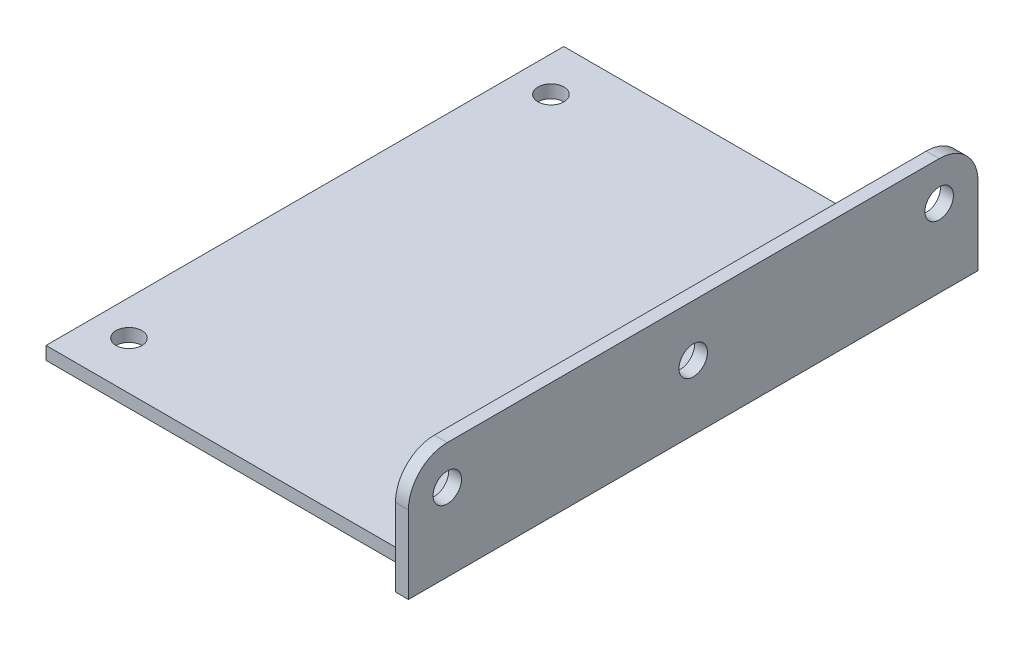
ISO-10303-21;
HEADER;
FILE_DESCRIPTION(('STEP AP214'),'2;1');
FILE_NAME('part.step','',(''),(''),'','','');
FILE_SCHEMA(('AUTOMOTIVE_DESIGN { 1 0 10303 214 1 1 1 1 }'));
ENDSEC;
DATA;
#1=APPLICATION_CONTEXT('core data for automotive mechanical design processes');
#2=APPLICATION_PROTOCOL_DEFINITION('international standard','automotive_design',2000,#1);
#3=PRODUCT_CONTEXT('',#1,'mechanical');
#4=PRODUCT('Part','Part','',(#3));
#5=PRODUCT_RELATED_PRODUCT_CATEGORY('part','',(#4));
#6=PRODUCT_DEFINITION_FORMATION('','',#4);
#7=PRODUCT_DEFINITION_CONTEXT('part definition',#1,'design');
#8=PRODUCT_DEFINITION('design','',#6,#7);
#9=PRODUCT_DEFINITION_SHAPE('','',#8);
#10=(LENGTH_UNIT() NAMED_UNIT(*) SI_UNIT(.MILLI.,.METRE.));
#11=(NAMED_UNIT(*) PLANE_ANGLE_UNIT() SI_UNIT($,.RADIAN.));
#12=(NAMED_UNIT(*) SI_UNIT($,.STERADIAN.) SOLID_ANGLE_UNIT());
#13=UNCERTAINTY_MEASURE_WITH_UNIT(LENGTH_MEASURE(1.E-05),#10,'distance_accuracy_value','');
#14=(GEOMETRIC_REPRESENTATION_CONTEXT(3) GLOBAL_UNCERTAINTY_ASSIGNED_CONTEXT((#13)) GLOBAL_UNIT_ASSIGNED_CONTEXT((#10,
#11,#12)) REPRESENTATION_CONTEXT('',''));
#15=CARTESIAN_POINT('',(0.,0.,0.));
#16=DIRECTION('',(0.,0.,1.));
#17=DIRECTION('',(1.,0.,0.));
#18=AXIS2_PLACEMENT_3D('',#15,#16,#17);
#19=CARTESIAN_POINT('',(-30.,1.,20.));
#20=DIRECTION('',(0.,0.,-1.));
#21=DIRECTION('',(-1.,0.,0.));
#22=AXIS2_PLACEMENT_3D('',#19,#20,#21);
#23=PLANE('',#22);
#24=DIRECTION('',(0.,-1.,0.));
#25=VECTOR('',#24,1.);
#26=CARTESIAN_POINT('',(-0.999999999999997,1.,20.));
#27=LINE('',#26,#25);
#28=CARTESIAN_POINT('',(-0.999999999999997,1.,20.));
#29=VERTEX_POINT('',#28);
#30=CARTESIAN_POINT('',(-0.999999999999997,0.,20.));
#31=VERTEX_POINT('',#30);
#32=EDGE_CURVE('E173',#29,#31,#27,.T.);
#33=ORIENTED_EDGE('',*,*,#32,.F.);
#34=DIRECTION('',(1.,0.,0.));
#35=VECTOR('',#34,1.);
#36=CARTESIAN_POINT('',(-30.,1.,20.));
#37=LINE('',#36,#35);
#38=CARTESIAN_POINT('',(-30.,1.,20.));
#39=VERTEX_POINT('',#38);
#40=EDGE_CURVE('E182',#39,#29,#37,.T.);
#41=ORIENTED_EDGE('',*,*,#40,.F.);
#42=DIRECTION('',(0.,-1.,0.));
#43=VECTOR('',#42,1.);
#44=CARTESIAN_POINT('',(-30.,1.,20.));
#45=LINE('',#44,#43);
#46=CARTESIAN_POINT('',(-30.,0.,20.));
#47=VERTEX_POINT('',#46);
#48=EDGE_CURVE('E204',#39,#47,#45,.T.);
#49=ORIENTED_EDGE('',*,*,#48,.T.);
#50=DIRECTION('',(1.,0.,0.));
#51=VECTOR('',#50,1.);
#52=CARTESIAN_POINT('',(-30.,0.,20.));
#53=LINE('',#52,#51);
#54=EDGE_CURVE('E193',#47,#31,#53,.T.);
#55=ORIENTED_EDGE('',*,*,#54,.T.);
#56=EDGE_LOOP('',(#33,#41,#49,#55));
#57=FACE_BOUND('',#56,.T.);
#58=ADVANCED_FACE('F39',(#57),#23,.F.);
#59=CARTESIAN_POINT('',(-30.,1.,-20.));
#60=DIRECTION('',(0.,0.,1.));
#61=DIRECTION('',(1.,0.,0.));
#62=AXIS2_PLACEMENT_3D('',#59,#60,#61);
#63=PLANE('',#62);
#64=DIRECTION('',(0.,1.,0.));
#65=VECTOR('',#64,1.);
#66=CARTESIAN_POINT('',(-1.,1.,-20.));
#67=LINE('',#66,#65);
#68=CARTESIAN_POINT('',(-0.999999999999997,0.,-20.));
#69=VERTEX_POINT('',#68);
#70=CARTESIAN_POINT('',(-0.999999999999997,1.,-20.));
#71=VERTEX_POINT('',#70);
#72=EDGE_CURVE('E170',#69,#71,#67,.T.);
#73=ORIENTED_EDGE('',*,*,#72,.F.);
#74=DIRECTION('',(-1.,0.,0.));
#75=VECTOR('',#74,1.);
#76=CARTESIAN_POINT('',(-30.,0.,-20.));
#77=LINE('',#76,#75);
#78=CARTESIAN_POINT('',(-30.,0.,-20.));
#79=VERTEX_POINT('',#78);
#80=EDGE_CURVE('E135',#69,#79,#77,.T.);
#81=ORIENTED_EDGE('',*,*,#80,.T.);
#82=DIRECTION('',(0.,-1.,0.));
#83=VECTOR('',#82,1.);
#84=CARTESIAN_POINT('',(-30.,1.,-20.));
#85=LINE('',#84,#83);
#86=CARTESIAN_POINT('',(-30.,1.,-20.));
#87=VERTEX_POINT('',#86);
#88=EDGE_CURVE('E189',#87,#79,#85,.T.);
#89=ORIENTED_EDGE('',*,*,#88,.F.);
#90=DIRECTION('',(-1.,0.,0.));
#91=VECTOR('',#90,1.);
#92=CARTESIAN_POINT('',(-30.,1.,-20.));
#93=LINE('',#92,#91);
#94=EDGE_CURVE('E186',#71,#87,#93,.T.);
#95=ORIENTED_EDGE('',*,*,#94,.F.);
#96=EDGE_LOOP('',(#73,#81,#89,#95));
#97=FACE_BOUND('',#96,.T.);
#98=ADVANCED_FACE('F248',(#97),#63,.F.);
#99=CARTESIAN_POINT('',(0.,1.,0.));
#100=DIRECTION('',(0.,-1.,0.));
#101=DIRECTION('',(0.,0.,-1.));
#102=AXIS2_PLACEMENT_3D('',#99,#100,#101);
#103=PLANE('',#102);
#104=CARTESIAN_POINT('',(-27.29,1.,16.3));
#105=DIRECTION('',(0.,-1.,0.));
#106=DIRECTION('',(0.,0.,-1.));
#107=AXIS2_PLACEMENT_3D('',#104,#105,#106);
#108=CIRCLE('',#107,0.999999999999989);
#109=CARTESIAN_POINT('',(-27.29,1.,15.3));
#110=VERTEX_POINT('',#109);
#111=EDGE_CURVE('E309',#110,#110,#108,.T.);
#112=ORIENTED_EDGE('',*,*,#111,.T.);
#113=EDGE_LOOP('',(#112));
#114=FACE_BOUND('',#113,.T.);
#115=CARTESIAN_POINT('',(-27.29,1.,-16.3));
#116=DIRECTION('',(0.,-1.,0.));
#117=DIRECTION('',(0.,0.,-1.));
#118=AXIS2_PLACEMENT_3D('',#115,#116,#117);
#119=CIRCLE('',#118,0.999999999999987);
#120=CARTESIAN_POINT('',(-27.29,1.,-17.3));
#121=VERTEX_POINT('',#120);
#122=EDGE_CURVE('E287',#121,#121,#119,.T.);
#123=ORIENTED_EDGE('',*,*,#122,.T.);
#124=EDGE_LOOP('',(#123));
#125=FACE_BOUND('',#124,.T.);
#126=DIRECTION('',(0.,0.,1.));
#127=VECTOR('',#126,1.);
#128=CARTESIAN_POINT('',(-0.999999999999997,1.,0.));
#129=LINE('',#128,#127);
#130=EDGE_CURVE('E125',#71,#29,#129,.T.);
#131=ORIENTED_EDGE('',*,*,#130,.F.);
#132=ORIENTED_EDGE('',*,*,#94,.T.);
#133=DIRECTION('',(0.,0.,1.));
#134=VECTOR('',#133,1.);
#135=CARTESIAN_POINT('',(-30.,1.,20.));
#136=LINE('',#135,#134);
#137=EDGE_CURVE('E178',#87,#39,#136,.T.);
#138=ORIENTED_EDGE('',*,*,#137,.T.);
#139=ORIENTED_EDGE('',*,*,#40,.T.);
#140=EDGE_LOOP('',(#131,#132,#138,#139));
#141=FACE_BOUND('',#140,.T.);
#142=ADVANCED_FACE('F254',(#114,#125,#141),#103,.F.);
#143=CARTESIAN_POINT('',(-30.,1.,20.));
#144=DIRECTION('',(1.,0.,0.));
#145=DIRECTION('',(0.,0.,-1.));
#146=AXIS2_PLACEMENT_3D('',#143,#144,#145);
#147=PLANE('',#146);
#148=DIRECTION('',(0.,0.,1.));
#149=VECTOR('',#148,1.);
#150=CARTESIAN_POINT('',(-30.,0.,20.));
#151=LINE('',#150,#149);
#152=EDGE_CURVE('E177',#79,#47,#151,.T.);
#153=ORIENTED_EDGE('',*,*,#152,.T.);
#154=ORIENTED_EDGE('',*,*,#48,.F.);
#155=ORIENTED_EDGE('',*,*,#137,.F.);
#156=ORIENTED_EDGE('',*,*,#88,.T.);
#157=EDGE_LOOP('',(#153,#154,#155,#156));
#158=FACE_BOUND('',#157,.T.);
#159=ADVANCED_FACE('F258',(#158),#147,.F.);
#160=CARTESIAN_POINT('',(0.,1.,20.));
#161=DIRECTION('',(-1.,0.,0.));
#162=DIRECTION('',(0.,0.,1.));
#163=AXIS2_PLACEMENT_3D('',#160,#161,#162);
#164=PLANE('',#163);
#165=CARTESIAN_POINT('',(0.,6.,19.));
#166=DIRECTION('',(1.,0.,0.));
#167=DIRECTION('',(0.,0.,-1.));
#168=AXIS2_PLACEMENT_3D('',#165,#166,#167);
#169=CIRCLE('',#168,1.1);
#170=CARTESIAN_POINT('',(0.,6.,17.9));
#171=VERTEX_POINT('',#170);
#172=EDGE_CURVE('E150',#171,#171,#169,.T.);
#173=ORIENTED_EDGE('',*,*,#172,.F.);
#174=EDGE_LOOP('',(#173));
#175=FACE_BOUND('',#174,.T.);
#176=CARTESIAN_POINT('',(0.,6.,-19.));
#177=DIRECTION('',(1.,0.,0.));
#178=DIRECTION('',(0.,0.,-1.));
#179=AXIS2_PLACEMENT_3D('',#176,#177,#178);
#180=CIRCLE('',#179,1.1);
#181=CARTESIAN_POINT('',(0.,6.,-20.1));
#182=VERTEX_POINT('',#181);
#183=EDGE_CURVE('E291',#182,#182,#180,.T.);
#184=ORIENTED_EDGE('',*,*,#183,.F.);
#185=EDGE_LOOP('',(#184));
#186=FACE_BOUND('',#185,.T.);
#187=CARTESIAN_POINT('',(0.,5.,0.));
#188=DIRECTION('',(1.,0.,0.));
#189=DIRECTION('',(0.,0.,-1.));
#190=AXIS2_PLACEMENT_3D('',#187,#188,#189);
#191=CIRCLE('',#190,1.1);
#192=CARTESIAN_POINT('',(0.,5.,-1.1));
#193=VERTEX_POINT('',#192);
#194=EDGE_CURVE('E282',#193,#193,#191,.T.);
#195=ORIENTED_EDGE('',*,*,#194,.F.);
#196=EDGE_LOOP('',(#195));
#197=FACE_BOUND('',#196,.T.);
#198=DIRECTION('',(0.,-1.,0.));
#199=VECTOR('',#198,1.);
#200=CARTESIAN_POINT('',(0.,9.,-22.));
#201=LINE('',#200,#199);
#202=CARTESIAN_POINT('',(0.,6.,-22.));
#203=VERTEX_POINT('',#202);
#204=CARTESIAN_POINT('',(0.,0.,-22.));
#205=VERTEX_POINT('',#204);
#206=EDGE_CURVE('E141',#203,#205,#201,.T.);
#207=ORIENTED_EDGE('',*,*,#206,.F.);
#208=CARTESIAN_POINT('',(0.,6.,-19.));
#209=DIRECTION('',(-1.,0.,0.));
#210=DIRECTION('',(0.,0.,1.));
#211=AXIS2_PLACEMENT_3D('',#208,#209,#210);
#212=CIRCLE('',#211,3.);
#213=CARTESIAN_POINT('',(0.,9.,-19.));
#214=VERTEX_POINT('',#213);
#215=EDGE_CURVE('E48',#203,#214,#212,.F.);
#216=ORIENTED_EDGE('',*,*,#215,.T.);
#217=DIRECTION('',(0.,0.,-1.));
#218=VECTOR('',#217,1.);
#219=CARTESIAN_POINT('',(0.,9.,22.));
#220=LINE('',#219,#218);
#221=CARTESIAN_POINT('',(0.,9.,19.));
#222=VERTEX_POINT('',#221);
#223=EDGE_CURVE('E153',#222,#214,#220,.T.);
#224=ORIENTED_EDGE('',*,*,#223,.F.);
#225=CARTESIAN_POINT('',(0.,6.,19.));
#226=DIRECTION('',(-1.,0.,0.));
#227=DIRECTION('',(0.,0.,1.));
#228=AXIS2_PLACEMENT_3D('',#225,#226,#227);
#229=CIRCLE('',#228,3.);
#230=CARTESIAN_POINT('',(0.,6.,22.));
#231=VERTEX_POINT('',#230);
#232=EDGE_CURVE('E55',#222,#231,#229,.F.);
#233=ORIENTED_EDGE('',*,*,#232,.T.);
#234=DIRECTION('',(0.,-1.,0.));
#235=VECTOR('',#234,1.);
#236=CARTESIAN_POINT('',(0.,9.,22.));
#237=LINE('',#236,#235);
#238=CARTESIAN_POINT('',(0.,0.,22.));
#239=VERTEX_POINT('',#238);
#240=EDGE_CURVE('E162',#231,#239,#237,.T.);
#241=ORIENTED_EDGE('',*,*,#240,.T.);
#242=DIRECTION('',(0.,0.,-1.));
#243=VECTOR('',#242,1.);
#244=CARTESIAN_POINT('',(0.,0.,20.));
#245=LINE('',#244,#243);
#246=EDGE_CURVE('E196',#239,#205,#245,.T.);
#247=ORIENTED_EDGE('',*,*,#246,.T.);
#248=EDGE_LOOP('',(#207,#216,#224,#233,#241,#247));
#249=FACE_BOUND('',#248,.T.);
#250=ADVANCED_FACE('F227',(#175,#186,#197,#249),#164,.F.);
#251=CARTESIAN_POINT('',(0.,0.,0.));
#252=DIRECTION('',(0.,-1.,0.));
#253=DIRECTION('',(0.,0.,-1.));
#254=AXIS2_PLACEMENT_3D('',#251,#252,#253);
#255=PLANE('',#254);
#256=CARTESIAN_POINT('',(-27.29,0.,16.3));
#257=DIRECTION('',(0.,-1.,0.));
#258=DIRECTION('',(0.,0.,-1.));
#259=AXIS2_PLACEMENT_3D('',#256,#257,#258);
#260=CIRCLE('',#259,0.99999999999999);
#261=CARTESIAN_POINT('',(-27.29,0.,15.3));
#262=VERTEX_POINT('',#261);
#263=EDGE_CURVE('E313',#262,#262,#260,.T.);
#264=ORIENTED_EDGE('',*,*,#263,.F.);
#265=EDGE_LOOP('',(#264));
#266=FACE_BOUND('',#265,.T.);
#267=CARTESIAN_POINT('',(-27.29,0.,-16.3));
#268=DIRECTION('',(0.,-1.,0.));
#269=DIRECTION('',(0.,0.,-1.));
#270=AXIS2_PLACEMENT_3D('',#267,#268,#269);
#271=CIRCLE('',#270,0.999999999999987);
#272=CARTESIAN_POINT('',(-27.29,0.,-17.3));
#273=VERTEX_POINT('',#272);
#274=EDGE_CURVE('E305',#273,#273,#271,.T.);
#275=ORIENTED_EDGE('',*,*,#274,.F.);
#276=EDGE_LOOP('',(#275));
#277=FACE_BOUND('',#276,.T.);
#278=ORIENTED_EDGE('',*,*,#246,.F.);
#279=DIRECTION('',(1.,0.,0.));
#280=VECTOR('',#279,1.);
#281=CARTESIAN_POINT('',(-0.999999999999995,0.,22.));
#282=LINE('',#281,#280);
#283=CARTESIAN_POINT('',(-0.999999999999995,0.,22.));
#284=VERTEX_POINT('',#283);
#285=EDGE_CURVE('E137',#284,#239,#282,.T.);
#286=ORIENTED_EDGE('',*,*,#285,.F.);
#287=DIRECTION('',(0.,0.,1.));
#288=VECTOR('',#287,1.);
#289=CARTESIAN_POINT('',(-1.,0.,-22.));
#290=LINE('',#289,#288);
#291=EDGE_CURVE('E138',#31,#284,#290,.T.);
#292=ORIENTED_EDGE('',*,*,#291,.F.);
#293=ORIENTED_EDGE('',*,*,#54,.F.);
#294=ORIENTED_EDGE('',*,*,#152,.F.);
#295=ORIENTED_EDGE('',*,*,#80,.F.);
#296=CARTESIAN_POINT('',(-1.,0.,-22.));
#297=VERTEX_POINT('',#296);
#298=EDGE_CURVE('E121',#297,#69,#290,.T.);
#299=ORIENTED_EDGE('',*,*,#298,.F.);
#300=DIRECTION('',(-1.,0.,0.));
#301=VECTOR('',#300,1.);
#302=CARTESIAN_POINT('',(0.,0.,-22.));
#303=LINE('',#302,#301);
#304=EDGE_CURVE('E133',#205,#297,#303,.T.);
#305=ORIENTED_EDGE('',*,*,#304,.F.);
#306=EDGE_LOOP('',(#278,#286,#292,#293,#294,#295,#299,#305));
#307=FACE_BOUND('',#306,.T.);
#308=ADVANCED_FACE('F132',(#266,#277,#307),#255,.T.);
#309=CARTESIAN_POINT('',(-1.,9.,-22.));
#310=DIRECTION('',(1.,0.,0.));
#311=DIRECTION('',(0.,0.,-1.));
#312=AXIS2_PLACEMENT_3D('',#309,#310,#311);
#313=PLANE('',#312);
#314=CARTESIAN_POINT('',(-1.,6.,19.));
#315=DIRECTION('',(1.,0.,0.));
#316=DIRECTION('',(0.,0.,-1.));
#317=AXIS2_PLACEMENT_3D('',#314,#315,#316);
#318=CIRCLE('',#317,1.1);
#319=CARTESIAN_POINT('',(-1.,6.,17.9));
#320=VERTEX_POINT('',#319);
#321=EDGE_CURVE('E144',#320,#320,#318,.T.);
#322=ORIENTED_EDGE('',*,*,#321,.T.);
#323=EDGE_LOOP('',(#322));
#324=FACE_BOUND('',#323,.T.);
#325=CARTESIAN_POINT('',(-1.,6.,-19.));
#326=DIRECTION('',(1.,0.,0.));
#327=DIRECTION('',(0.,0.,-1.));
#328=AXIS2_PLACEMENT_3D('',#325,#326,#327);
#329=CIRCLE('',#328,1.1);
#330=CARTESIAN_POINT('',(-1.,6.,-20.1));
#331=VERTEX_POINT('',#330);
#332=EDGE_CURVE('E295',#331,#331,#329,.T.);
#333=ORIENTED_EDGE('',*,*,#332,.T.);
#334=EDGE_LOOP('',(#333));
#335=FACE_BOUND('',#334,.T.);
#336=CARTESIAN_POINT('',(-1.,5.,0.));
#337=DIRECTION('',(1.,0.,0.));
#338=DIRECTION('',(0.,0.,-1.));
#339=AXIS2_PLACEMENT_3D('',#336,#337,#338);
#340=CIRCLE('',#339,1.1);
#341=CARTESIAN_POINT('',(-1.,5.,-1.1));
#342=VERTEX_POINT('',#341);
#343=EDGE_CURVE('E286',#342,#342,#340,.T.);
#344=ORIENTED_EDGE('',*,*,#343,.T.);
#345=EDGE_LOOP('',(#344));
#346=FACE_BOUND('',#345,.T.);
#347=DIRECTION('',(0.,0.,1.));
#348=VECTOR('',#347,1.);
#349=CARTESIAN_POINT('',(-1.,9.,-22.));
#350=LINE('',#349,#348);
#351=CARTESIAN_POINT('',(-1.,9.,-19.));
#352=VERTEX_POINT('',#351);
#353=CARTESIAN_POINT('',(-0.999999999999995,9.,19.));
#354=VERTEX_POINT('',#353);
#355=EDGE_CURVE('E159',#352,#354,#350,.T.);
#356=ORIENTED_EDGE('',*,*,#355,.F.);
#357=CARTESIAN_POINT('',(-1.,6.,-19.));
#358=DIRECTION('',(1.,0.,0.));
#359=DIRECTION('',(0.,0.,-1.));
#360=AXIS2_PLACEMENT_3D('',#357,#358,#359);
#361=CIRCLE('',#360,3.);
#362=CARTESIAN_POINT('',(-1.,6.,-22.));
#363=VERTEX_POINT('',#362);
#364=EDGE_CURVE('E122',#352,#363,#361,.F.);
#365=ORIENTED_EDGE('',*,*,#364,.T.);
#366=DIRECTION('',(0.,-1.,0.));
#367=VECTOR('',#366,1.);
#368=CARTESIAN_POINT('',(-1.,9.,-22.));
#369=LINE('',#368,#367);
#370=EDGE_CURVE('E116',#363,#297,#369,.T.);
#371=ORIENTED_EDGE('',*,*,#370,.T.);
#372=ORIENTED_EDGE('',*,*,#298,.T.);
#373=ORIENTED_EDGE('',*,*,#72,.T.);
#374=ORIENTED_EDGE('',*,*,#130,.T.);
#375=ORIENTED_EDGE('',*,*,#32,.T.);
#376=ORIENTED_EDGE('',*,*,#291,.T.);
#377=DIRECTION('',(0.,-1.,0.));
#378=VECTOR('',#377,1.);
#379=CARTESIAN_POINT('',(-0.999999999999995,9.,22.));
#380=LINE('',#379,#378);
#381=CARTESIAN_POINT('',(-0.999999999999995,6.,22.));
#382=VERTEX_POINT('',#381);
#383=EDGE_CURVE('E126',#382,#284,#380,.T.);
#384=ORIENTED_EDGE('',*,*,#383,.F.);
#385=CARTESIAN_POINT('',(-0.999999999999995,6.,19.));
#386=DIRECTION('',(1.,0.,0.));
#387=DIRECTION('',(0.,0.,-1.));
#388=AXIS2_PLACEMENT_3D('',#385,#386,#387);
#389=CIRCLE('',#388,3.);
#390=EDGE_CURVE('E216',#382,#354,#389,.F.);
#391=ORIENTED_EDGE('',*,*,#390,.T.);
#392=EDGE_LOOP('',(#356,#365,#371,#372,#373,#374,#375,#376,#384,#391));
#393=FACE_BOUND('',#392,.T.);
#394=ADVANCED_FACE('F119',(#324,#335,#346,#393),#313,.F.);
#395=CARTESIAN_POINT('',(0.,9.,-22.));
#396=DIRECTION('',(0.,0.,1.));
#397=DIRECTION('',(1.,0.,0.));
#398=AXIS2_PLACEMENT_3D('',#395,#396,#397);
#399=PLANE('',#398);
#400=ORIENTED_EDGE('',*,*,#370,.F.);
#401=DIRECTION('',(-1.,0.,0.));
#402=VECTOR('',#401,1.);
#403=CARTESIAN_POINT('',(0.,6.,-22.));
#404=LINE('',#403,#402);
#405=EDGE_CURVE('E63',#363,#203,#404,.F.);
#406=ORIENTED_EDGE('',*,*,#405,.T.);
#407=ORIENTED_EDGE('',*,*,#206,.T.);
#408=ORIENTED_EDGE('',*,*,#304,.T.);
#409=EDGE_LOOP('',(#400,#406,#407,#408));
#410=FACE_BOUND('',#409,.T.);
#411=ADVANCED_FACE('F140',(#410),#399,.F.);
#412=CARTESIAN_POINT('',(-0.999999999999995,9.,22.));
#413=DIRECTION('',(0.,0.,-1.));
#414=DIRECTION('',(-1.,0.,0.));
#415=AXIS2_PLACEMENT_3D('',#412,#413,#414);
#416=PLANE('',#415);
#417=ORIENTED_EDGE('',*,*,#240,.F.);
#418=DIRECTION('',(1.,0.,0.));
#419=VECTOR('',#418,1.);
#420=CARTESIAN_POINT('',(-0.999999999999995,6.,22.));
#421=LINE('',#420,#419);
#422=EDGE_CURVE('E11',#231,#382,#421,.F.);
#423=ORIENTED_EDGE('',*,*,#422,.T.);
#424=ORIENTED_EDGE('',*,*,#383,.T.);
#425=ORIENTED_EDGE('',*,*,#285,.T.);
#426=EDGE_LOOP('',(#417,#423,#424,#425));
#427=FACE_BOUND('',#426,.T.);
#428=ADVANCED_FACE('F278',(#427),#416,.F.);
#429=CARTESIAN_POINT('',(0.,9.,0.));
#430=DIRECTION('',(0.,1.,0.));
#431=DIRECTION('',(0.,0.,1.));
#432=AXIS2_PLACEMENT_3D('',#429,#430,#431);
#433=PLANE('',#432);
#434=ORIENTED_EDGE('',*,*,#223,.T.);
#435=DIRECTION('',(-1.,0.,0.));
#436=VECTOR('',#435,1.);
#437=CARTESIAN_POINT('',(-1.,9.,-19.));
#438=LINE('',#437,#436);
#439=EDGE_CURVE('E212',#214,#352,#438,.T.);
#440=ORIENTED_EDGE('',*,*,#439,.T.);
#441=ORIENTED_EDGE('',*,*,#355,.T.);
#442=DIRECTION('',(1.,0.,0.));
#443=VECTOR('',#442,1.);
#444=CARTESIAN_POINT('',(0.,9.,19.));
#445=LINE('',#444,#443);
#446=EDGE_CURVE('E208',#354,#222,#445,.T.);
#447=ORIENTED_EDGE('',*,*,#446,.T.);
#448=EDGE_LOOP('',(#434,#440,#441,#447));
#449=FACE_BOUND('',#448,.T.);
#450=ADVANCED_FACE('F231',(#449),#433,.T.);
#451=CARTESIAN_POINT('',(-1.,5.,0.));
#452=DIRECTION('',(1.,0.,0.));
#453=DIRECTION('',(0.,0.,-1.));
#454=AXIS2_PLACEMENT_3D('',#451,#452,#453);
#455=CYLINDRICAL_SURFACE('',#454,1.1);
#456=ORIENTED_EDGE('',*,*,#343,.F.);
#457=EDGE_LOOP('',(#456));
#458=FACE_BOUND('',#457,.T.);
#459=ORIENTED_EDGE('',*,*,#194,.T.);
#460=EDGE_LOOP('',(#459));
#461=FACE_BOUND('',#460,.T.);
#462=ADVANCED_FACE('F339',(#458,#461),#455,.F.);
#463=CARTESIAN_POINT('',(-1.,6.,-19.));
#464=DIRECTION('',(1.,0.,0.));
#465=DIRECTION('',(0.,0.,-1.));
#466=AXIS2_PLACEMENT_3D('',#463,#464,#465);
#467=CYLINDRICAL_SURFACE('',#466,1.1);
#468=ORIENTED_EDGE('',*,*,#332,.F.);
#469=EDGE_LOOP('',(#468));
#470=FACE_BOUND('',#469,.T.);
#471=ORIENTED_EDGE('',*,*,#183,.T.);
#472=EDGE_LOOP('',(#471));
#473=FACE_BOUND('',#472,.T.);
#474=ADVANCED_FACE('F333',(#470,#473),#467,.F.);
#475=CARTESIAN_POINT('',(-1.,6.,19.));
#476=DIRECTION('',(1.,0.,0.));
#477=DIRECTION('',(0.,0.,-1.));
#478=AXIS2_PLACEMENT_3D('',#475,#476,#477);
#479=CYLINDRICAL_SURFACE('',#478,1.1);
#480=ORIENTED_EDGE('',*,*,#321,.F.);
#481=EDGE_LOOP('',(#480));
#482=FACE_BOUND('',#481,.T.);
#483=ORIENTED_EDGE('',*,*,#172,.T.);
#484=EDGE_LOOP('',(#483));
#485=FACE_BOUND('',#484,.T.);
#486=ADVANCED_FACE('F326',(#482,#485),#479,.F.);
#487=CARTESIAN_POINT('',(-27.29,0.,-16.3));
#488=DIRECTION('',(0.,-1.,0.));
#489=DIRECTION('',(0.,0.,-1.));
#490=AXIS2_PLACEMENT_3D('',#487,#488,#489);
#491=CYLINDRICAL_SURFACE('',#490,0.999999999999987);
#492=ORIENTED_EDGE('',*,*,#274,.T.);
#493=EDGE_LOOP('',(#492));
#494=FACE_BOUND('',#493,.T.);
#495=ORIENTED_EDGE('',*,*,#122,.F.);
#496=EDGE_LOOP('',(#495));
#497=FACE_BOUND('',#496,.T.);
#498=ADVANCED_FACE('F243',(#494,#497),#491,.F.);
#499=CARTESIAN_POINT('',(-27.29,0.,16.3));
#500=DIRECTION('',(0.,-1.,0.));
#501=DIRECTION('',(0.,0.,-1.));
#502=AXIS2_PLACEMENT_3D('',#499,#500,#501);
#503=CYLINDRICAL_SURFACE('',#502,0.999999999999989);
#504=ORIENTED_EDGE('',*,*,#263,.T.);
#505=EDGE_LOOP('',(#504));
#506=FACE_BOUND('',#505,.T.);
#507=ORIENTED_EDGE('',*,*,#111,.F.);
#508=EDGE_LOOP('',(#507));
#509=FACE_BOUND('',#508,.T.);
#510=ADVANCED_FACE('F237',(#506,#509),#503,.F.);
#511=CARTESIAN_POINT('',(0.,6.,-19.));
#512=DIRECTION('',(1.,0.,0.));
#513=DIRECTION('',(0.,0.,-1.));
#514=AXIS2_PLACEMENT_3D('',#511,#512,#513);
#515=CYLINDRICAL_SURFACE('',#514,3.);
#516=ORIENTED_EDGE('',*,*,#215,.F.);
#517=ORIENTED_EDGE('',*,*,#405,.F.);
#518=ORIENTED_EDGE('',*,*,#364,.F.);
#519=ORIENTED_EDGE('',*,*,#439,.F.);
#520=EDGE_LOOP('',(#516,#517,#518,#519));
#521=FACE_BOUND('',#520,.T.);
#522=ADVANCED_FACE('F235',(#521),#515,.T.);
#523=CARTESIAN_POINT('',(0.,6.,19.));
#524=DIRECTION('',(-1.,0.,0.));
#525=DIRECTION('',(0.,0.,1.));
#526=AXIS2_PLACEMENT_3D('',#523,#524,#525);
#527=CYLINDRICAL_SURFACE('',#526,3.);
#528=ORIENTED_EDGE('',*,*,#390,.F.);
#529=ORIENTED_EDGE('',*,*,#422,.F.);
#530=ORIENTED_EDGE('',*,*,#232,.F.);
#531=ORIENTED_EDGE('',*,*,#446,.F.);
#532=EDGE_LOOP('',(#528,#529,#530,#531));
#533=FACE_BOUND('',#532,.T.);
#534=ADVANCED_FACE('F41',(#533),#527,.T.);
#535=CLOSED_SHELL('',(#58,#98,#142,#159,#250,#308,#394,#411,#428,#450,#462,#474,#486,#498,#510,
#522,#534));
#536=MANIFOLD_SOLID_BREP('B2',#535);
#537=ADVANCED_BREP_SHAPE_REPRESENTATION('',(#18,#536),#14);
#538=SHAPE_DEFINITION_REPRESENTATION(#9,#537);
ENDSEC;
END-ISO-10303-21;
